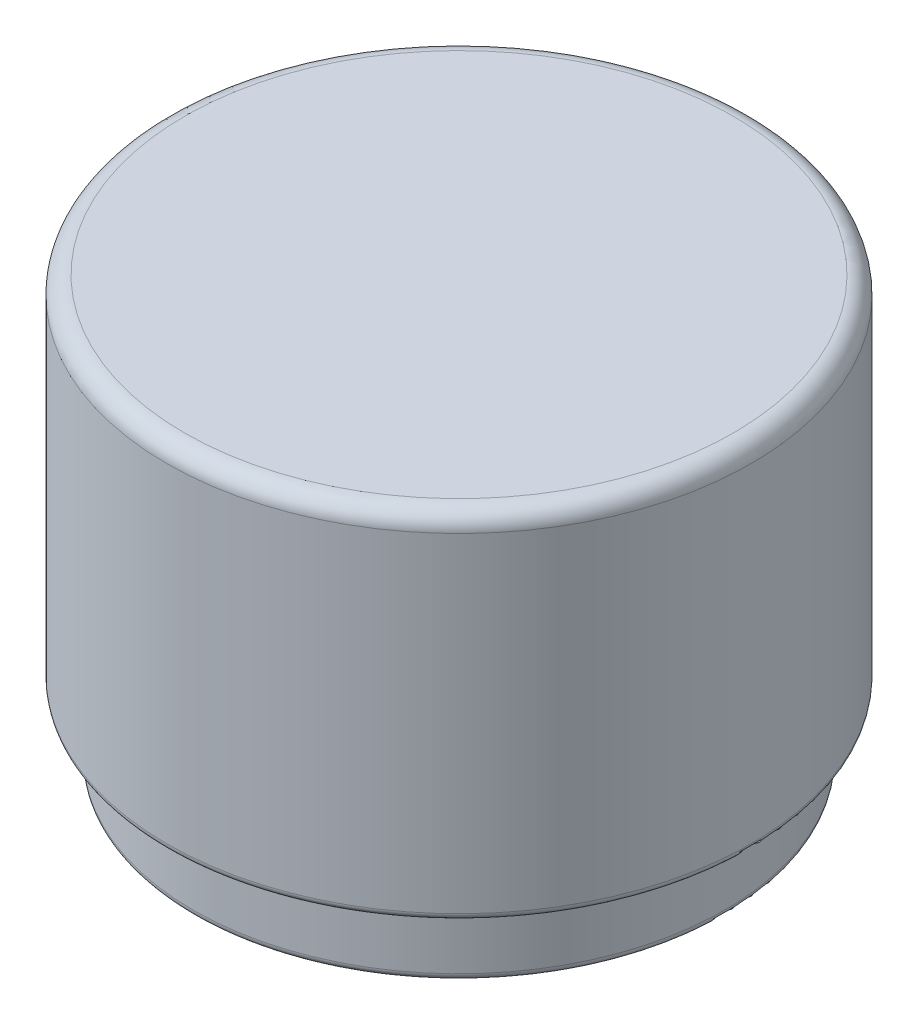
ISO-10303-21;
HEADER;
FILE_DESCRIPTION(('STEP AP214'),'2;1');
FILE_NAME('part.step','',(''),(''),'','','');
FILE_SCHEMA(('AUTOMOTIVE_DESIGN { 1 0 10303 214 1 1 1 1 }'));
ENDSEC;
DATA;
#1=APPLICATION_CONTEXT('core data for automotive mechanical design processes');
#2=APPLICATION_PROTOCOL_DEFINITION('international standard','automotive_design',2000,#1);
#3=PRODUCT_CONTEXT('',#1,'mechanical');
#4=PRODUCT('Part','Part','',(#3));
#5=PRODUCT_RELATED_PRODUCT_CATEGORY('part','',(#4));
#6=PRODUCT_DEFINITION_FORMATION('','',#4);
#7=PRODUCT_DEFINITION_CONTEXT('part definition',#1,'design');
#8=PRODUCT_DEFINITION('design','',#6,#7);
#9=PRODUCT_DEFINITION_SHAPE('','',#8);
#10=(LENGTH_UNIT() NAMED_UNIT(*) SI_UNIT(.MILLI.,.METRE.));
#11=(NAMED_UNIT(*) PLANE_ANGLE_UNIT() SI_UNIT($,.RADIAN.));
#12=(NAMED_UNIT(*) SI_UNIT($,.STERADIAN.) SOLID_ANGLE_UNIT());
#13=UNCERTAINTY_MEASURE_WITH_UNIT(LENGTH_MEASURE(1.E-05),#10,'distance_accuracy_value','');
#14=(GEOMETRIC_REPRESENTATION_CONTEXT(3) GLOBAL_UNCERTAINTY_ASSIGNED_CONTEXT((#13)) GLOBAL_UNIT_ASSIGNED_CONTEXT((#10,
#11,#12)) REPRESENTATION_CONTEXT('',''));
#15=CARTESIAN_POINT('',(0.,0.,0.));
#16=DIRECTION('',(0.,0.,1.));
#17=DIRECTION('',(1.,0.,0.));
#18=AXIS2_PLACEMENT_3D('',#15,#16,#17);
#19=CARTESIAN_POINT('',(0.,-0.5,0.));
#20=DIRECTION('',(0.,-1.,0.));
#21=DIRECTION('',(0.,0.,-1.));
#22=AXIS2_PLACEMENT_3D('',#19,#20,#21);
#23=PLANE('',#22);
#24=CARTESIAN_POINT('',(0.,-0.5,0.));
#25=DIRECTION('',(0.,-1.,0.));
#26=DIRECTION('',(0.,0.,-1.));
#27=AXIS2_PLACEMENT_3D('',#24,#25,#26);
#28=CIRCLE('',#27,7.55);
#29=CARTESIAN_POINT('',(0.,-0.499999999999999,-7.55));
#30=VERTEX_POINT('',#29);
#31=EDGE_CURVE('E62',#30,#30,#28,.T.);
#32=ORIENTED_EDGE('',*,*,#31,.T.);
#33=EDGE_LOOP('',(#32));
#34=FACE_BOUND('',#33,.T.);
#35=ADVANCED_FACE('F30',(#34),#23,.T.);
#36=CARTESIAN_POINT('',(0.,0.,0.));
#37=DIRECTION('',(0.,1.,0.));
#38=DIRECTION('',(0.,0.,1.));
#39=AXIS2_PLACEMENT_3D('',#36,#37,#38);
#40=CYLINDRICAL_SURFACE('',#39,7.75);
#41=CARTESIAN_POINT('',(0.,-0.7,0.));
#42=DIRECTION('',(0.,-1.,0.));
#43=DIRECTION('',(0.,0.,-1.));
#44=AXIS2_PLACEMENT_3D('',#41,#42,#43);
#45=CIRCLE('',#44,7.75);
#46=CARTESIAN_POINT('',(0.,-0.699999999999999,-7.75));
#47=VERTEX_POINT('',#46);
#48=EDGE_CURVE('E65',#47,#47,#45,.F.);
#49=ORIENTED_EDGE('',*,*,#48,.T.);
#50=EDGE_LOOP('',(#49));
#51=FACE_BOUND('',#50,.T.);
#52=CARTESIAN_POINT('',(0.,-9.5,0.));
#53=DIRECTION('',(0.,1.,0.));
#54=DIRECTION('',(0.,0.,1.));
#55=AXIS2_PLACEMENT_3D('',#52,#53,#54);
#56=CIRCLE('',#55,7.75);
#57=CARTESIAN_POINT('',(0.,-9.5,7.75));
#58=VERTEX_POINT('',#57);
#59=EDGE_CURVE('E74',#58,#58,#56,.T.);
#60=ORIENTED_EDGE('',*,*,#59,.F.);
#61=EDGE_LOOP('',(#60));
#62=FACE_BOUND('',#61,.T.);
#63=ADVANCED_FACE('F98',(#51,#62),#40,.F.);
#64=CARTESIAN_POINT('',(0.,-9.5,7.));
#65=DIRECTION('',(0.,1.,0.));
#66=DIRECTION('',(0.,0.,1.));
#67=AXIS2_PLACEMENT_3D('',#64,#65,#66);
#68=PLANE('',#67);
#69=CARTESIAN_POINT('',(0.,-9.5,0.));
#70=DIRECTION('',(0.,1.,0.));
#71=DIRECTION('',(0.,0.,1.));
#72=AXIS2_PLACEMENT_3D('',#69,#70,#71);
#73=CIRCLE('',#72,7.2);
#74=CARTESIAN_POINT('',(0.,-9.5,7.2));
#75=VERTEX_POINT('',#74);
#76=EDGE_CURVE('E53',#75,#75,#73,.F.);
#77=ORIENTED_EDGE('',*,*,#76,.T.);
#78=EDGE_LOOP('',(#77));
#79=FACE_BOUND('',#78,.T.);
#80=ORIENTED_EDGE('',*,*,#59,.T.);
#81=EDGE_LOOP('',(#80));
#82=FACE_BOUND('',#81,.T.);
#83=ADVANCED_FACE('F104',(#79,#82),#68,.T.);
#84=CARTESIAN_POINT('',(0.,0.,0.));
#85=DIRECTION('',(0.,1.,0.));
#86=DIRECTION('',(0.,0.,1.));
#87=AXIS2_PLACEMENT_3D('',#84,#85,#86);
#88=CYLINDRICAL_SURFACE('',#87,7.);
#89=CARTESIAN_POINT('',(0.,-9.7,0.));
#90=DIRECTION('',(0.,1.,0.));
#91=DIRECTION('',(0.,0.,1.));
#92=AXIS2_PLACEMENT_3D('',#89,#90,#91);
#93=CIRCLE('',#92,7.);
#94=CARTESIAN_POINT('',(0.,-9.7,7.));
#95=VERTEX_POINT('',#94);
#96=EDGE_CURVE('E56',#95,#95,#93,.T.);
#97=ORIENTED_EDGE('',*,*,#96,.T.);
#98=EDGE_LOOP('',(#97));
#99=FACE_BOUND('',#98,.T.);
#100=CARTESIAN_POINT('',(0.,-11.8,0.));
#101=DIRECTION('',(0.,-1.,0.));
#102=DIRECTION('',(0.,0.,-1.));
#103=AXIS2_PLACEMENT_3D('',#100,#101,#102);
#104=CIRCLE('',#103,7.);
#105=CARTESIAN_POINT('',(0.,-11.8,-7.));
#106=VERTEX_POINT('',#105);
#107=EDGE_CURVE('E59',#106,#106,#104,.T.);
#108=ORIENTED_EDGE('',*,*,#107,.T.);
#109=EDGE_LOOP('',(#108));
#110=FACE_BOUND('',#109,.T.);
#111=ADVANCED_FACE('F94',(#99,#110),#88,.F.);
#112=CARTESIAN_POINT('',(0.,-12.,7.));
#113=DIRECTION('',(0.,-1.,0.));
#114=DIRECTION('',(0.,0.,-1.));
#115=AXIS2_PLACEMENT_3D('',#112,#113,#114);
#116=PLANE('',#115);
#117=CARTESIAN_POINT('',(0.,-12.,0.));
#118=DIRECTION('',(0.,-1.,0.));
#119=DIRECTION('',(0.,0.,-1.));
#120=AXIS2_PLACEMENT_3D('',#117,#118,#119);
#121=CIRCLE('',#120,7.2);
#122=CARTESIAN_POINT('',(0.,-12.,-7.2));
#123=VERTEX_POINT('',#122);
#124=EDGE_CURVE('E45',#123,#123,#121,.F.);
#125=ORIENTED_EDGE('',*,*,#124,.T.);
#126=EDGE_LOOP('',(#125));
#127=FACE_BOUND('',#126,.T.);
#128=CARTESIAN_POINT('',(0.,-12.,0.));
#129=DIRECTION('',(0.,-1.,0.));
#130=DIRECTION('',(0.,0.,-1.));
#131=AXIS2_PLACEMENT_3D('',#128,#129,#130);
#132=CIRCLE('',#131,7.3);
#133=CARTESIAN_POINT('',(0.,-12.,-7.3));
#134=VERTEX_POINT('',#133);
#135=EDGE_CURVE('E50',#134,#134,#132,.T.);
#136=ORIENTED_EDGE('',*,*,#135,.T.);
#137=EDGE_LOOP('',(#136));
#138=FACE_BOUND('',#137,.T.);
#139=ADVANCED_FACE('F85',(#127,#138),#116,.T.);
#140=CARTESIAN_POINT('',(0.,0.,0.));
#141=DIRECTION('',(0.,1.,0.));
#142=DIRECTION('',(0.,0.,1.));
#143=AXIS2_PLACEMENT_3D('',#140,#141,#142);
#144=CYLINDRICAL_SURFACE('',#143,7.5);
#145=CARTESIAN_POINT('',(0.,-11.8,0.));
#146=DIRECTION('',(0.,-1.,0.));
#147=DIRECTION('',(0.,0.,-1.));
#148=AXIS2_PLACEMENT_3D('',#145,#146,#147);
#149=CIRCLE('',#148,7.5);
#150=CARTESIAN_POINT('',(0.,-11.8,-7.5));
#151=VERTEX_POINT('',#150);
#152=EDGE_CURVE('E41',#151,#151,#149,.F.);
#153=ORIENTED_EDGE('',*,*,#152,.T.);
#154=EDGE_LOOP('',(#153));
#155=FACE_BOUND('',#154,.T.);
#156=CARTESIAN_POINT('',(0.,-10.,0.));
#157=DIRECTION('',(0.,1.,0.));
#158=DIRECTION('',(0.,0.,1.));
#159=AXIS2_PLACEMENT_3D('',#156,#157,#158);
#160=CIRCLE('',#159,7.5);
#161=CARTESIAN_POINT('',(0.,-10.,7.5));
#162=VERTEX_POINT('',#161);
#163=EDGE_CURVE('E77',#162,#162,#160,.T.);
#164=ORIENTED_EDGE('',*,*,#163,.F.);
#165=EDGE_LOOP('',(#164));
#166=FACE_BOUND('',#165,.T.);
#167=ADVANCED_FACE('F83',(#155,#166),#144,.T.);
#168=CARTESIAN_POINT('',(0.,-10.,7.5));
#169=DIRECTION('',(0.,-1.,0.));
#170=DIRECTION('',(0.,0.,-1.));
#171=AXIS2_PLACEMENT_3D('',#168,#169,#170);
#172=PLANE('',#171);
#173=CARTESIAN_POINT('',(0.,-10.,0.));
#174=DIRECTION('',(0.,-1.,0.));
#175=DIRECTION('',(0.,0.,-1.));
#176=AXIS2_PLACEMENT_3D('',#173,#174,#175);
#177=CIRCLE('',#176,8.05);
#178=CARTESIAN_POINT('',(0.,-10.,-8.05));
#179=VERTEX_POINT('',#178);
#180=EDGE_CURVE('E10',#179,#179,#177,.T.);
#181=ORIENTED_EDGE('',*,*,#180,.T.);
#182=EDGE_LOOP('',(#181));
#183=FACE_BOUND('',#182,.T.);
#184=ORIENTED_EDGE('',*,*,#163,.T.);
#185=EDGE_LOOP('',(#184));
#186=FACE_BOUND('',#185,.T.);
#187=ADVANCED_FACE('F81',(#183,#186),#172,.T.);
#188=CARTESIAN_POINT('',(0.,0.,0.));
#189=DIRECTION('',(0.,1.,0.));
#190=DIRECTION('',(0.,0.,1.));
#191=AXIS2_PLACEMENT_3D('',#188,#189,#190);
#192=CYLINDRICAL_SURFACE('',#191,8.25);
#193=CARTESIAN_POINT('',(0.,-9.8,0.));
#194=DIRECTION('',(0.,-1.,0.));
#195=DIRECTION('',(0.,0.,-1.));
#196=AXIS2_PLACEMENT_3D('',#193,#194,#195);
#197=CIRCLE('',#196,8.25);
#198=CARTESIAN_POINT('',(0.,-9.8,-8.25));
#199=VERTEX_POINT('',#198);
#200=EDGE_CURVE('E37',#199,#199,#197,.F.);
#201=ORIENTED_EDGE('',*,*,#200,.T.);
#202=EDGE_LOOP('',(#201));
#203=FACE_BOUND('',#202,.T.);
#204=CARTESIAN_POINT('',(0.,-0.5,0.));
#205=DIRECTION('',(0.,1.,0.));
#206=DIRECTION('',(0.,0.,1.));
#207=AXIS2_PLACEMENT_3D('',#204,#205,#206);
#208=CIRCLE('',#207,8.25);
#209=CARTESIAN_POINT('',(0.,-0.500000000000001,8.25));
#210=VERTEX_POINT('',#209);
#211=EDGE_CURVE('E68',#210,#210,#208,.F.);
#212=ORIENTED_EDGE('',*,*,#211,.T.);
#213=EDGE_LOOP('',(#212));
#214=FACE_BOUND('',#213,.T.);
#215=ADVANCED_FACE('F92',(#203,#214),#192,.T.);
#216=CARTESIAN_POINT('',(0.,0.,0.));
#217=DIRECTION('',(0.,1.,0.));
#218=DIRECTION('',(0.,0.,1.));
#219=AXIS2_PLACEMENT_3D('',#216,#217,#218);
#220=PLANE('',#219);
#221=CARTESIAN_POINT('',(0.,0.,0.));
#222=DIRECTION('',(0.,1.,0.));
#223=DIRECTION('',(0.,0.,1.));
#224=AXIS2_PLACEMENT_3D('',#221,#222,#223);
#225=CIRCLE('',#224,7.75);
#226=CARTESIAN_POINT('',(0.,0.,7.75));
#227=VERTEX_POINT('',#226);
#228=EDGE_CURVE('E71',#227,#227,#225,.T.);
#229=ORIENTED_EDGE('',*,*,#228,.T.);
#230=EDGE_LOOP('',(#229));
#231=FACE_BOUND('',#230,.T.);
#232=ADVANCED_FACE('F113',(#231),#220,.T.);
#233=CARTESIAN_POINT('',(0.,-0.5,0.));
#234=DIRECTION('',(0.,1.,0.));
#235=DIRECTION('',(0.,0.,1.));
#236=AXIS2_PLACEMENT_3D('',#233,#234,#235);
#237=TOROIDAL_SURFACE('',#236,7.75,0.5);
#238=ORIENTED_EDGE('',*,*,#211,.F.);
#239=EDGE_LOOP('',(#238));
#240=FACE_BOUND('',#239,.T.);
#241=ORIENTED_EDGE('',*,*,#228,.F.);
#242=EDGE_LOOP('',(#241));
#243=FACE_BOUND('',#242,.T.);
#244=ADVANCED_FACE('F109',(#240,#243),#237,.T.);
#245=CARTESIAN_POINT('',(0.,-0.7,0.));
#246=DIRECTION('',(0.,-1.,0.));
#247=DIRECTION('',(0.,0.,-1.));
#248=AXIS2_PLACEMENT_3D('',#245,#246,#247);
#249=TOROIDAL_SURFACE('',#248,7.55,0.2);
#250=ORIENTED_EDGE('',*,*,#31,.F.);
#251=EDGE_LOOP('',(#250));
#252=FACE_BOUND('',#251,.T.);
#253=ORIENTED_EDGE('',*,*,#48,.F.);
#254=EDGE_LOOP('',(#253));
#255=FACE_BOUND('',#254,.T.);
#256=ADVANCED_FACE('F112',(#252,#255),#249,.F.);
#257=CARTESIAN_POINT('',(0.,-9.7,0.));
#258=DIRECTION('',(0.,1.,0.));
#259=DIRECTION('',(0.,0.,1.));
#260=AXIS2_PLACEMENT_3D('',#257,#258,#259);
#261=TOROIDAL_SURFACE('',#260,7.2,0.2);
#262=ORIENTED_EDGE('',*,*,#76,.F.);
#263=EDGE_LOOP('',(#262));
#264=FACE_BOUND('',#263,.T.);
#265=ORIENTED_EDGE('',*,*,#96,.F.);
#266=EDGE_LOOP('',(#265));
#267=FACE_BOUND('',#266,.T.);
#268=ADVANCED_FACE('F117',(#264,#267),#261,.T.);
#269=CARTESIAN_POINT('',(0.,-11.8,0.));
#270=DIRECTION('',(0.,-1.,0.));
#271=DIRECTION('',(0.,0.,-1.));
#272=AXIS2_PLACEMENT_3D('',#269,#270,#271);
#273=TOROIDAL_SURFACE('',#272,7.2,0.2);
#274=ORIENTED_EDGE('',*,*,#107,.F.);
#275=EDGE_LOOP('',(#274));
#276=FACE_BOUND('',#275,.T.);
#277=ORIENTED_EDGE('',*,*,#124,.F.);
#278=EDGE_LOOP('',(#277));
#279=FACE_BOUND('',#278,.T.);
#280=ADVANCED_FACE('F121',(#276,#279),#273,.T.);
#281=CARTESIAN_POINT('',(0.,-11.8,0.));
#282=DIRECTION('',(0.,-1.,0.));
#283=DIRECTION('',(0.,0.,-1.));
#284=AXIS2_PLACEMENT_3D('',#281,#282,#283);
#285=TOROIDAL_SURFACE('',#284,7.3,0.2);
#286=ORIENTED_EDGE('',*,*,#135,.F.);
#287=EDGE_LOOP('',(#286));
#288=FACE_BOUND('',#287,.T.);
#289=ORIENTED_EDGE('',*,*,#152,.F.);
#290=EDGE_LOOP('',(#289));
#291=FACE_BOUND('',#290,.T.);
#292=ADVANCED_FACE('F124',(#288,#291),#285,.T.);
#293=CARTESIAN_POINT('',(0.,-9.8,0.));
#294=DIRECTION('',(0.,-1.,0.));
#295=DIRECTION('',(0.,0.,-1.));
#296=AXIS2_PLACEMENT_3D('',#293,#294,#295);
#297=TOROIDAL_SURFACE('',#296,8.05,0.2);
#298=ORIENTED_EDGE('',*,*,#180,.F.);
#299=EDGE_LOOP('',(#298));
#300=FACE_BOUND('',#299,.T.);
#301=ORIENTED_EDGE('',*,*,#200,.F.);
#302=EDGE_LOOP('',(#301));
#303=FACE_BOUND('',#302,.T.);
#304=ADVANCED_FACE('F32',(#300,#303),#297,.T.);
#305=CLOSED_SHELL('',(#35,#63,#83,#111,#139,#167,#187,#215,#232,#244,#256,#268,#280,#292,#304));
#306=MANIFOLD_SOLID_BREP('B2',#305);
#307=ADVANCED_BREP_SHAPE_REPRESENTATION('',(#18,#306),#14);
#308=SHAPE_DEFINITION_REPRESENTATION(#9,#307);
ENDSEC;
END-ISO-10303-21;
